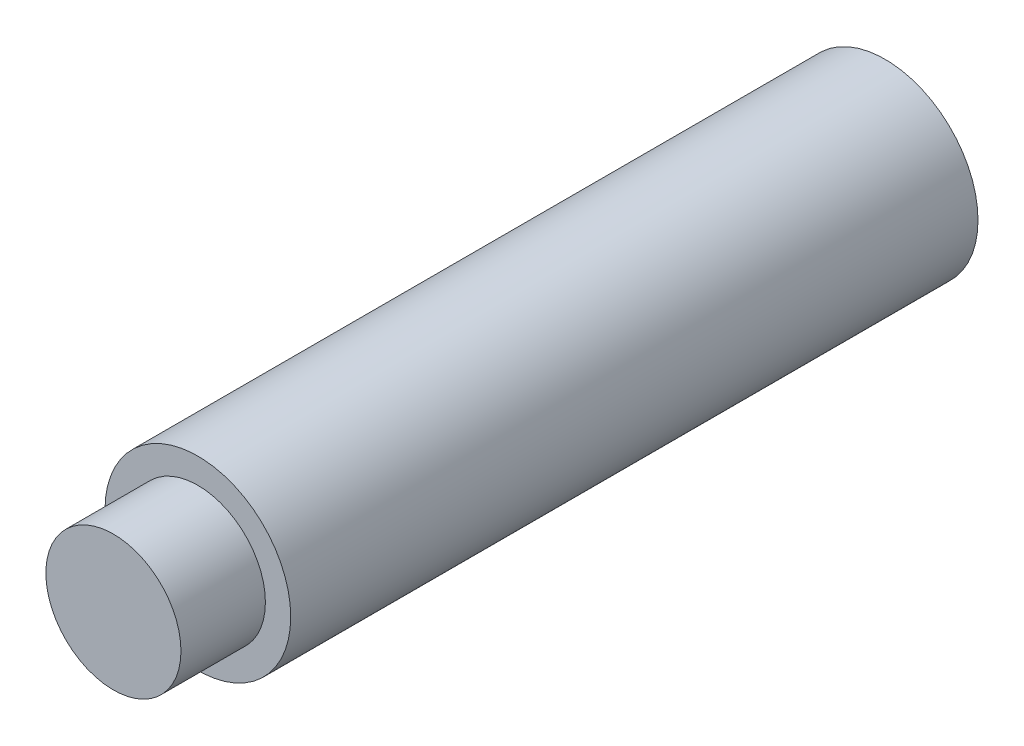
ISO-10303-21;
HEADER;
FILE_DESCRIPTION(('STEP AP214'),'2;1');
FILE_NAME('part.step','',(''),(''),'','','');
FILE_SCHEMA(('AUTOMOTIVE_DESIGN { 1 0 10303 214 1 1 1 1 }'));
ENDSEC;
DATA;
#1=APPLICATION_CONTEXT('core data for automotive mechanical design processes');
#2=APPLICATION_PROTOCOL_DEFINITION('international standard','automotive_design',2000,#1);
#3=PRODUCT_CONTEXT('',#1,'mechanical');
#4=PRODUCT('Part','Part','',(#3));
#5=PRODUCT_RELATED_PRODUCT_CATEGORY('part','',(#4));
#6=PRODUCT_DEFINITION_FORMATION('','',#4);
#7=PRODUCT_DEFINITION_CONTEXT('part definition',#1,'design');
#8=PRODUCT_DEFINITION('design','',#6,#7);
#9=PRODUCT_DEFINITION_SHAPE('','',#8);
#10=(LENGTH_UNIT() NAMED_UNIT(*) SI_UNIT(.MILLI.,.METRE.));
#11=(NAMED_UNIT(*) PLANE_ANGLE_UNIT() SI_UNIT($,.RADIAN.));
#12=(NAMED_UNIT(*) SI_UNIT($,.STERADIAN.) SOLID_ANGLE_UNIT());
#13=UNCERTAINTY_MEASURE_WITH_UNIT(LENGTH_MEASURE(1.E-05),#10,'distance_accuracy_value','');
#14=(GEOMETRIC_REPRESENTATION_CONTEXT(3) GLOBAL_UNCERTAINTY_ASSIGNED_CONTEXT((#13)) GLOBAL_UNIT_ASSIGNED_CONTEXT((#10,
#11,#12)) REPRESENTATION_CONTEXT('',''));
#15=CARTESIAN_POINT('',(0.,0.,0.));
#16=DIRECTION('',(0.,0.,1.));
#17=DIRECTION('',(1.,0.,0.));
#18=AXIS2_PLACEMENT_3D('',#15,#16,#17);
#19=CARTESIAN_POINT('',(0.,4.,0.));
#20=DIRECTION('',(0.,0.,-1.));
#21=DIRECTION('',(-1.,0.,0.));
#22=AXIS2_PLACEMENT_3D('',#19,#20,#21);
#23=PLANE('',#22);
#24=CARTESIAN_POINT('',(0.,0.,0.));
#25=DIRECTION('',(0.,0.,1.));
#26=DIRECTION('',(1.,0.,0.));
#27=AXIS2_PLACEMENT_3D('',#24,#25,#26);
#28=CIRCLE('',#27,4.);
#29=CARTESIAN_POINT('',(4.,0.,0.));
#30=VERTEX_POINT('',#29);
#31=EDGE_CURVE('E52',#30,#30,#28,.T.);
#32=ORIENTED_EDGE('',*,*,#31,.T.);
#33=EDGE_LOOP('',(#32));
#34=FACE_BOUND('',#33,.T.);
#35=ADVANCED_FACE('F33',(#34),#23,.F.);
#36=CARTESIAN_POINT('',(0.,0.,-45.7));
#37=DIRECTION('',(0.,0.,1.));
#38=DIRECTION('',(1.,0.,0.));
#39=AXIS2_PLACEMENT_3D('',#36,#37,#38);
#40=PLANE('',#39);
#41=CARTESIAN_POINT('',(0.,0.,-45.7));
#42=DIRECTION('',(0.,0.,-1.));
#43=DIRECTION('',(-1.,0.,0.));
#44=AXIS2_PLACEMENT_3D('',#41,#42,#43);
#45=CIRCLE('',#44,2.5);
#46=CARTESIAN_POINT('',(-2.5,0.,-45.7));
#47=VERTEX_POINT('',#46);
#48=EDGE_CURVE('E53',#47,#47,#45,.T.);
#49=ORIENTED_EDGE('',*,*,#48,.F.);
#50=EDGE_LOOP('',(#49));
#51=FACE_BOUND('',#50,.T.);
#52=CARTESIAN_POINT('',(0.,0.,-45.7));
#53=DIRECTION('',(0.,0.,1.));
#54=DIRECTION('',(1.,0.,0.));
#55=AXIS2_PLACEMENT_3D('',#52,#53,#54);
#56=CIRCLE('',#55,5.5);
#57=CARTESIAN_POINT('',(5.5,0.,-45.7));
#58=VERTEX_POINT('',#57);
#59=EDGE_CURVE('E11',#58,#58,#56,.T.);
#60=ORIENTED_EDGE('',*,*,#59,.F.);
#61=EDGE_LOOP('',(#60));
#62=FACE_BOUND('',#61,.T.);
#63=ADVANCED_FACE('F70',(#51,#62),#40,.F.);
#64=CARTESIAN_POINT('',(0.,0.,0.));
#65=DIRECTION('',(0.,0.,1.));
#66=DIRECTION('',(1.,0.,0.));
#67=AXIS2_PLACEMENT_3D('',#64,#65,#66);
#68=CYLINDRICAL_SURFACE('',#67,5.5);
#69=CARTESIAN_POINT('',(0.,0.,-5.));
#70=DIRECTION('',(0.,0.,1.));
#71=DIRECTION('',(1.,0.,0.));
#72=AXIS2_PLACEMENT_3D('',#69,#70,#71);
#73=CIRCLE('',#72,5.49999999999999);
#74=CARTESIAN_POINT('',(5.49999999999999,0.,-5.));
#75=VERTEX_POINT('',#74);
#76=EDGE_CURVE('E39',#75,#75,#73,.T.);
#77=ORIENTED_EDGE('',*,*,#76,.F.);
#78=EDGE_LOOP('',(#77));
#79=FACE_BOUND('',#78,.T.);
#80=ORIENTED_EDGE('',*,*,#59,.T.);
#81=EDGE_LOOP('',(#80));
#82=FACE_BOUND('',#81,.T.);
#83=ADVANCED_FACE('F67',(#79,#82),#68,.T.);
#84=CARTESIAN_POINT('',(0.,5.49999999999999,-5.));
#85=DIRECTION('',(0.,0.,-1.));
#86=DIRECTION('',(-1.,0.,0.));
#87=AXIS2_PLACEMENT_3D('',#84,#85,#86);
#88=PLANE('',#87);
#89=CARTESIAN_POINT('',(0.,0.,-5.));
#90=DIRECTION('',(0.,0.,1.));
#91=DIRECTION('',(1.,0.,0.));
#92=AXIS2_PLACEMENT_3D('',#89,#90,#91);
#93=CIRCLE('',#92,4.);
#94=CARTESIAN_POINT('',(4.,0.,-5.));
#95=VERTEX_POINT('',#94);
#96=EDGE_CURVE('E56',#95,#95,#93,.T.);
#97=ORIENTED_EDGE('',*,*,#96,.F.);
#98=EDGE_LOOP('',(#97));
#99=FACE_BOUND('',#98,.T.);
#100=ORIENTED_EDGE('',*,*,#76,.T.);
#101=EDGE_LOOP('',(#100));
#102=FACE_BOUND('',#101,.T.);
#103=ADVANCED_FACE('F65',(#99,#102),#88,.F.);
#104=CARTESIAN_POINT('',(0.,0.,0.));
#105=DIRECTION('',(0.,0.,1.));
#106=DIRECTION('',(1.,0.,0.));
#107=AXIS2_PLACEMENT_3D('',#104,#105,#106);
#108=CYLINDRICAL_SURFACE('',#107,4.);
#109=ORIENTED_EDGE('',*,*,#31,.F.);
#110=EDGE_LOOP('',(#109));
#111=FACE_BOUND('',#110,.T.);
#112=ORIENTED_EDGE('',*,*,#96,.T.);
#113=EDGE_LOOP('',(#112));
#114=FACE_BOUND('',#113,.T.);
#115=ADVANCED_FACE('F46',(#111,#114),#108,.T.);
#116=CARTESIAN_POINT('',(0.,0.,-38.7));
#117=DIRECTION('',(0.,0.,-1.));
#118=DIRECTION('',(-1.,0.,0.));
#119=AXIS2_PLACEMENT_3D('',#116,#117,#118);
#120=CONICAL_SURFACE('',#119,2.5,1.02974425867665);
#121=CARTESIAN_POINT('',(0.,0.,-37.1978484524311));
#122=VERTEX_POINT('',#121);
#123=VERTEX_LOOP('',#122);
#124=FACE_BOUND('',#123,.T.);
#125=CARTESIAN_POINT('',(0.,0.,-38.7));
#126=DIRECTION('',(0.,0.,-1.));
#127=DIRECTION('',(-1.,0.,0.));
#128=AXIS2_PLACEMENT_3D('',#125,#126,#127);
#129=CIRCLE('',#128,2.5);
#130=CARTESIAN_POINT('',(-2.5,0.,-38.7));
#131=VERTEX_POINT('',#130);
#132=EDGE_CURVE('E50',#131,#131,#129,.T.);
#133=ORIENTED_EDGE('',*,*,#132,.T.);
#134=EDGE_LOOP('',(#133));
#135=FACE_BOUND('',#134,.T.);
#136=ADVANCED_FACE('F42',(#124,#135),#120,.F.);
#137=CARTESIAN_POINT('',(0.,0.,-45.7));
#138=DIRECTION('',(0.,0.,-1.));
#139=DIRECTION('',(-1.,0.,0.));
#140=AXIS2_PLACEMENT_3D('',#137,#138,#139);
#141=CYLINDRICAL_SURFACE('',#140,2.5);
#142=ORIENTED_EDGE('',*,*,#132,.F.);
#143=EDGE_LOOP('',(#142));
#144=FACE_BOUND('',#143,.T.);
#145=ORIENTED_EDGE('',*,*,#48,.T.);
#146=EDGE_LOOP('',(#145));
#147=FACE_BOUND('',#146,.T.);
#148=ADVANCED_FACE('F45',(#144,#147),#141,.F.);
#149=CLOSED_SHELL('',(#35,#63,#83,#103,#115,#136,#148));
#150=MANIFOLD_SOLID_BREP('B2',#149);
#151=ADVANCED_BREP_SHAPE_REPRESENTATION('',(#18,#150),#14);
#152=SHAPE_DEFINITION_REPRESENTATION(#9,#151);
ENDSEC;
END-ISO-10303-21;
